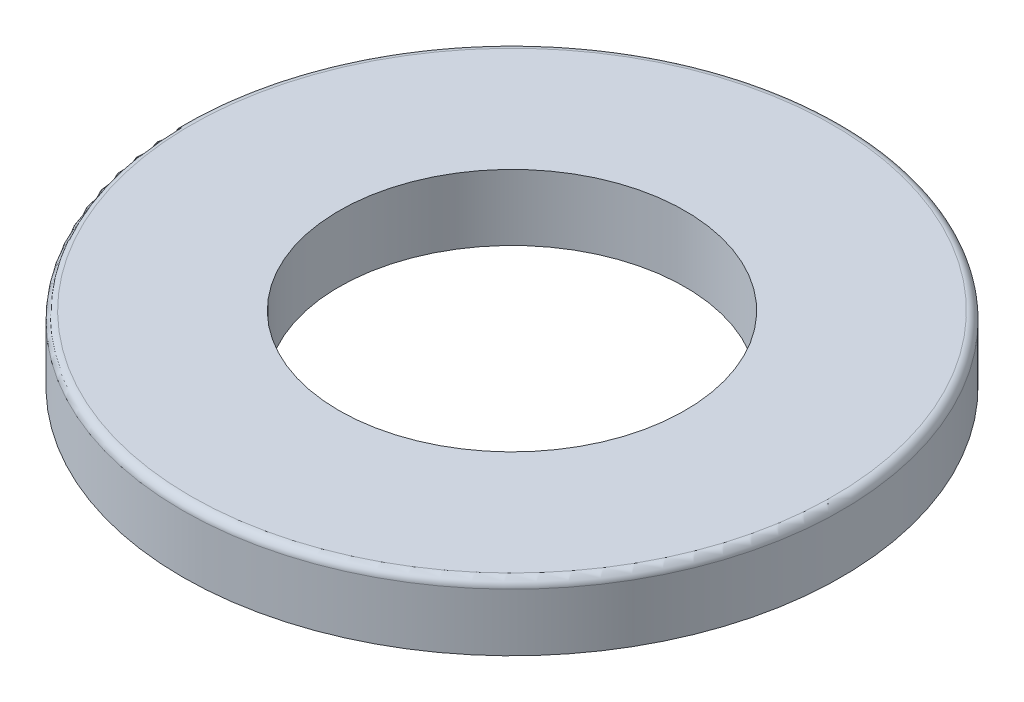
ISO-10303-21;
HEADER;
FILE_DESCRIPTION(('STEP AP214'),'2;1');
FILE_NAME('part.step','',(''),(''),'','','');
FILE_SCHEMA(('AUTOMOTIVE_DESIGN { 1 0 10303 214 1 1 1 1 }'));
ENDSEC;
DATA;
#1=APPLICATION_CONTEXT('core data for automotive mechanical design processes');
#2=APPLICATION_PROTOCOL_DEFINITION('international standard','automotive_design',2000,#1);
#3=PRODUCT_CONTEXT('',#1,'mechanical');
#4=PRODUCT('Part','Part','',(#3));
#5=PRODUCT_RELATED_PRODUCT_CATEGORY('part','',(#4));
#6=PRODUCT_DEFINITION_FORMATION('','',#4);
#7=PRODUCT_DEFINITION_CONTEXT('part definition',#1,'design');
#8=PRODUCT_DEFINITION('design','',#6,#7);
#9=PRODUCT_DEFINITION_SHAPE('','',#8);
#10=(LENGTH_UNIT() NAMED_UNIT(*) SI_UNIT(.MILLI.,.METRE.));
#11=(NAMED_UNIT(*) PLANE_ANGLE_UNIT() SI_UNIT($,.RADIAN.));
#12=(NAMED_UNIT(*) SI_UNIT($,.STERADIAN.) SOLID_ANGLE_UNIT());
#13=UNCERTAINTY_MEASURE_WITH_UNIT(LENGTH_MEASURE(1.E-05),#10,'distance_accuracy_value','');
#14=(GEOMETRIC_REPRESENTATION_CONTEXT(3) GLOBAL_UNCERTAINTY_ASSIGNED_CONTEXT((#13)) GLOBAL_UNIT_ASSIGNED_CONTEXT((#10,
#11,#12)) REPRESENTATION_CONTEXT('',''));
#15=CARTESIAN_POINT('',(0.,0.,0.));
#16=DIRECTION('',(0.,0.,1.));
#17=DIRECTION('',(1.,0.,0.));
#18=AXIS2_PLACEMENT_3D('',#15,#16,#17);
#19=CARTESIAN_POINT('',(0.,1.6,0.));
#20=DIRECTION('',(0.,1.,0.));
#21=DIRECTION('',(0.,0.,1.));
#22=AXIS2_PLACEMENT_3D('',#19,#20,#21);
#23=PLANE('',#22);
#24=CARTESIAN_POINT('',(0.,1.6,0.));
#25=DIRECTION('',(0.,1.,0.));
#26=DIRECTION('',(0.,0.,1.));
#27=AXIS2_PLACEMENT_3D('',#24,#25,#26);
#28=CIRCLE('',#27,7.8);
#29=CARTESIAN_POINT('',(0.,1.6,7.8));
#30=VERTEX_POINT('',#29);
#31=EDGE_CURVE('E37',#30,#30,#28,.T.);
#32=ORIENTED_EDGE('',*,*,#31,.T.);
#33=EDGE_LOOP('',(#32));
#34=FACE_BOUND('',#33,.T.);
#35=CARTESIAN_POINT('',(0.,1.6,0.));
#36=DIRECTION('',(0.,1.,0.));
#37=DIRECTION('',(0.,0.,1.));
#38=AXIS2_PLACEMENT_3D('',#35,#36,#37);
#39=CIRCLE('',#38,4.2);
#40=CARTESIAN_POINT('',(0.,1.6,4.2));
#41=VERTEX_POINT('',#40);
#42=EDGE_CURVE('E45',#41,#41,#39,.T.);
#43=ORIENTED_EDGE('',*,*,#42,.F.);
#44=EDGE_LOOP('',(#43));
#45=FACE_BOUND('',#44,.T.);
#46=ADVANCED_FACE('F30',(#34,#45),#23,.T.);
#47=CARTESIAN_POINT('',(0.,0.,0.));
#48=DIRECTION('',(0.,1.,0.));
#49=DIRECTION('',(0.,0.,1.));
#50=AXIS2_PLACEMENT_3D('',#47,#48,#49);
#51=PLANE('',#50);
#52=CARTESIAN_POINT('',(0.,0.,0.));
#53=DIRECTION('',(0.,1.,0.));
#54=DIRECTION('',(0.,0.,1.));
#55=AXIS2_PLACEMENT_3D('',#52,#53,#54);
#56=CIRCLE('',#55,8.);
#57=CARTESIAN_POINT('',(0.,0.,8.));
#58=VERTEX_POINT('',#57);
#59=EDGE_CURVE('E41',#58,#58,#56,.T.);
#60=ORIENTED_EDGE('',*,*,#59,.F.);
#61=EDGE_LOOP('',(#60));
#62=FACE_BOUND('',#61,.T.);
#63=CARTESIAN_POINT('',(0.,0.,0.));
#64=DIRECTION('',(0.,1.,0.));
#65=DIRECTION('',(0.,0.,1.));
#66=AXIS2_PLACEMENT_3D('',#63,#64,#65);
#67=CIRCLE('',#66,4.2);
#68=CARTESIAN_POINT('',(0.,0.,4.2));
#69=VERTEX_POINT('',#68);
#70=EDGE_CURVE('E48',#69,#69,#67,.T.);
#71=ORIENTED_EDGE('',*,*,#70,.T.);
#72=EDGE_LOOP('',(#71));
#73=FACE_BOUND('',#72,.T.);
#74=ADVANCED_FACE('F58',(#62,#73),#51,.F.);
#75=CARTESIAN_POINT('',(0.,1.6,0.));
#76=DIRECTION('',(0.,-1.,0.));
#77=DIRECTION('',(0.,0.,-1.));
#78=AXIS2_PLACEMENT_3D('',#75,#76,#77);
#79=CYLINDRICAL_SURFACE('',#78,8.);
#80=CARTESIAN_POINT('',(0.,1.4,0.));
#81=DIRECTION('',(0.,1.,0.));
#82=DIRECTION('',(0.,0.,1.));
#83=AXIS2_PLACEMENT_3D('',#80,#81,#82);
#84=CIRCLE('',#83,8.);
#85=CARTESIAN_POINT('',(0.,1.4,8.));
#86=VERTEX_POINT('',#85);
#87=EDGE_CURVE('E10',#86,#86,#84,.F.);
#88=ORIENTED_EDGE('',*,*,#87,.T.);
#89=EDGE_LOOP('',(#88));
#90=FACE_BOUND('',#89,.T.);
#91=ORIENTED_EDGE('',*,*,#59,.T.);
#92=EDGE_LOOP('',(#91));
#93=FACE_BOUND('',#92,.T.);
#94=ADVANCED_FACE('F63',(#90,#93),#79,.T.);
#95=CARTESIAN_POINT('',(0.,1.6,0.));
#96=DIRECTION('',(0.,-1.,0.));
#97=DIRECTION('',(0.,0.,-1.));
#98=AXIS2_PLACEMENT_3D('',#95,#96,#97);
#99=CYLINDRICAL_SURFACE('',#98,4.2);
#100=ORIENTED_EDGE('',*,*,#42,.T.);
#101=EDGE_LOOP('',(#100));
#102=FACE_BOUND('',#101,.T.);
#103=ORIENTED_EDGE('',*,*,#70,.F.);
#104=EDGE_LOOP('',(#103));
#105=FACE_BOUND('',#104,.T.);
#106=ADVANCED_FACE('F54',(#102,#105),#99,.F.);
#107=CARTESIAN_POINT('',(0.,1.4,0.));
#108=DIRECTION('',(0.,1.,0.));
#109=DIRECTION('',(0.,0.,1.));
#110=AXIS2_PLACEMENT_3D('',#107,#108,#109);
#111=TOROIDAL_SURFACE('',#110,7.8,0.2);
#112=ORIENTED_EDGE('',*,*,#87,.F.);
#113=EDGE_LOOP('',(#112));
#114=FACE_BOUND('',#113,.T.);
#115=ORIENTED_EDGE('',*,*,#31,.F.);
#116=EDGE_LOOP('',(#115));
#117=FACE_BOUND('',#116,.T.);
#118=ADVANCED_FACE('F32',(#114,#117),#111,.T.);
#119=CLOSED_SHELL('',(#46,#74,#94,#106,#118));
#120=MANIFOLD_SOLID_BREP('B2',#119);
#121=ADVANCED_BREP_SHAPE_REPRESENTATION('',(#18,#120),#14);
#122=SHAPE_DEFINITION_REPRESENTATION(#9,#121);
ENDSEC;
END-ISO-10303-21;
